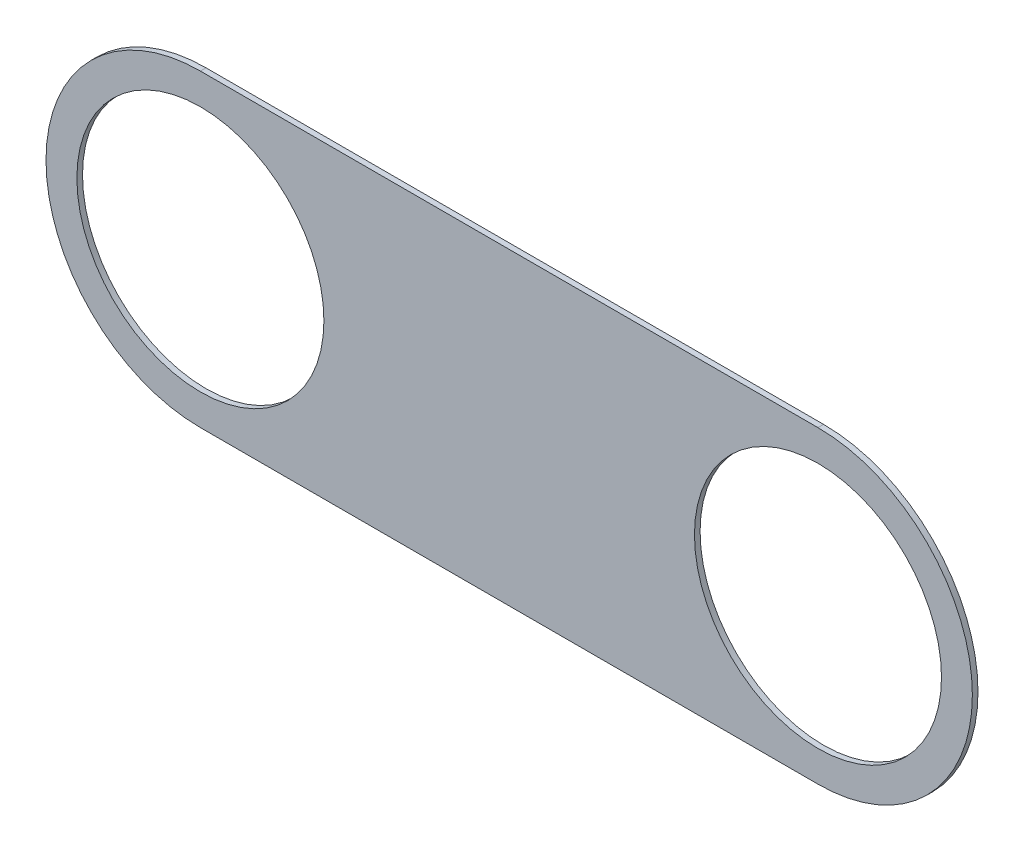
ISO-10303-21;
HEADER;
FILE_DESCRIPTION(('STEP AP214'),'2;1');
FILE_NAME('part.step','',(''),(''),'','','');
FILE_SCHEMA(('AUTOMOTIVE_DESIGN { 1 0 10303 214 1 1 1 1 }'));
ENDSEC;
DATA;
#1=APPLICATION_CONTEXT('core data for automotive mechanical design processes');
#2=APPLICATION_PROTOCOL_DEFINITION('international standard','automotive_design',2000,#1);
#3=PRODUCT_CONTEXT('',#1,'mechanical');
#4=PRODUCT('Part','Part','',(#3));
#5=PRODUCT_RELATED_PRODUCT_CATEGORY('part','',(#4));
#6=PRODUCT_DEFINITION_FORMATION('','',#4);
#7=PRODUCT_DEFINITION_CONTEXT('part definition',#1,'design');
#8=PRODUCT_DEFINITION('design','',#6,#7);
#9=PRODUCT_DEFINITION_SHAPE('','',#8);
#10=(LENGTH_UNIT() NAMED_UNIT(*) SI_UNIT(.MILLI.,.METRE.));
#11=(NAMED_UNIT(*) PLANE_ANGLE_UNIT() SI_UNIT($,.RADIAN.));
#12=(NAMED_UNIT(*) SI_UNIT($,.STERADIAN.) SOLID_ANGLE_UNIT());
#13=UNCERTAINTY_MEASURE_WITH_UNIT(LENGTH_MEASURE(1.E-05),#10,'distance_accuracy_value','');
#14=(GEOMETRIC_REPRESENTATION_CONTEXT(3) GLOBAL_UNCERTAINTY_ASSIGNED_CONTEXT((#13)) GLOBAL_UNIT_ASSIGNED_CONTEXT((#10,
#11,#12)) REPRESENTATION_CONTEXT('',''));
#15=CARTESIAN_POINT('',(0.,0.,0.));
#16=DIRECTION('',(0.,0.,1.));
#17=DIRECTION('',(1.,0.,0.));
#18=AXIS2_PLACEMENT_3D('',#15,#16,#17);
#19=CARTESIAN_POINT('',(-63.5,0.,1.15824));
#20=DIRECTION('',(0.,0.,1.));
#21=DIRECTION('',(1.,0.,0.));
#22=AXIS2_PLACEMENT_3D('',#19,#20,#21);
#23=PLANE('',#22);
#24=CARTESIAN_POINT('',(-63.5,0.,1.15824));
#25=DIRECTION('',(0.,0.,1.));
#26=DIRECTION('',(1.,0.,0.));
#27=AXIS2_PLACEMENT_3D('',#24,#25,#26);
#28=CIRCLE('',#27,25.4);
#29=CARTESIAN_POINT('',(-38.1,0.,1.15824));
#30=VERTEX_POINT('',#29);
#31=EDGE_CURVE('E102',#30,#30,#28,.T.);
#32=ORIENTED_EDGE('',*,*,#31,.F.);
#33=EDGE_LOOP('',(#32));
#34=FACE_BOUND('',#33,.T.);
#35=CARTESIAN_POINT('',(-63.5,0.,1.15824));
#36=DIRECTION('',(0.,0.,1.));
#37=DIRECTION('',(1.,0.,0.));
#38=AXIS2_PLACEMENT_3D('',#35,#36,#37);
#39=CIRCLE('',#38,31.75);
#40=CARTESIAN_POINT('',(-63.5,31.75,1.15824));
#41=VERTEX_POINT('',#40);
#42=CARTESIAN_POINT('',(-63.5,-31.75,1.15824));
#43=VERTEX_POINT('',#42);
#44=EDGE_CURVE('E87',#41,#43,#39,.T.);
#45=ORIENTED_EDGE('',*,*,#44,.T.);
#46=DIRECTION('',(1.,0.,0.));
#47=VECTOR('',#46,1.);
#48=CARTESIAN_POINT('',(-63.5,-31.75,1.15824));
#49=LINE('',#48,#47);
#50=CARTESIAN_POINT('',(63.5,-31.75,1.15824));
#51=VERTEX_POINT('',#50);
#52=EDGE_CURVE('E82',#43,#51,#49,.T.);
#53=ORIENTED_EDGE('',*,*,#52,.T.);
#54=CARTESIAN_POINT('',(63.5,0.,1.15824));
#55=DIRECTION('',(0.,0.,1.));
#56=DIRECTION('',(1.,0.,0.));
#57=AXIS2_PLACEMENT_3D('',#54,#55,#56);
#58=CIRCLE('',#57,31.75);
#59=CARTESIAN_POINT('',(63.5,31.75,1.15824));
#60=VERTEX_POINT('',#59);
#61=EDGE_CURVE('E85',#51,#60,#58,.T.);
#62=ORIENTED_EDGE('',*,*,#61,.T.);
#63=DIRECTION('',(-1.,0.,0.));
#64=VECTOR('',#63,1.);
#65=CARTESIAN_POINT('',(-63.5,31.75,1.15824));
#66=LINE('',#65,#64);
#67=EDGE_CURVE('E52',#60,#41,#66,.T.);
#68=ORIENTED_EDGE('',*,*,#67,.T.);
#69=EDGE_LOOP('',(#45,#53,#62,#68));
#70=FACE_BOUND('',#69,.T.);
#71=CARTESIAN_POINT('',(63.5,0.,1.15824));
#72=DIRECTION('',(0.,0.,1.));
#73=DIRECTION('',(1.,0.,0.));
#74=AXIS2_PLACEMENT_3D('',#71,#72,#73);
#75=CIRCLE('',#74,25.4);
#76=CARTESIAN_POINT('',(88.9,0.,1.15824));
#77=VERTEX_POINT('',#76);
#78=EDGE_CURVE('E117',#77,#77,#75,.T.);
#79=ORIENTED_EDGE('',*,*,#78,.F.);
#80=EDGE_LOOP('',(#79));
#81=FACE_BOUND('',#80,.T.);
#82=ADVANCED_FACE('F35',(#34,#70,#81),#23,.T.);
#83=CARTESIAN_POINT('',(-63.5,0.,0.));
#84=DIRECTION('',(0.,0.,1.));
#85=DIRECTION('',(1.,0.,0.));
#86=AXIS2_PLACEMENT_3D('',#83,#84,#85);
#87=PLANE('',#86);
#88=CARTESIAN_POINT('',(-63.5,0.,0.));
#89=DIRECTION('',(0.,0.,1.));
#90=DIRECTION('',(1.,0.,0.));
#91=AXIS2_PLACEMENT_3D('',#88,#89,#90);
#92=CIRCLE('',#91,25.4);
#93=CARTESIAN_POINT('',(-38.1,0.,0.));
#94=VERTEX_POINT('',#93);
#95=EDGE_CURVE('E114',#94,#94,#92,.T.);
#96=ORIENTED_EDGE('',*,*,#95,.T.);
#97=EDGE_LOOP('',(#96));
#98=FACE_BOUND('',#97,.T.);
#99=CARTESIAN_POINT('',(-63.5,0.,0.));
#100=DIRECTION('',(0.,0.,1.));
#101=DIRECTION('',(1.,0.,0.));
#102=AXIS2_PLACEMENT_3D('',#99,#100,#101);
#103=CIRCLE('',#102,31.75);
#104=CARTESIAN_POINT('',(-63.5,31.75,0.));
#105=VERTEX_POINT('',#104);
#106=CARTESIAN_POINT('',(-63.5,-31.75,0.));
#107=VERTEX_POINT('',#106);
#108=EDGE_CURVE('E99',#105,#107,#103,.T.);
#109=ORIENTED_EDGE('',*,*,#108,.F.);
#110=DIRECTION('',(-1.,0.,0.));
#111=VECTOR('',#110,1.);
#112=CARTESIAN_POINT('',(-63.5,31.75,0.));
#113=LINE('',#112,#111);
#114=CARTESIAN_POINT('',(63.5,31.75,0.));
#115=VERTEX_POINT('',#114);
#116=EDGE_CURVE('E75',#115,#105,#113,.T.);
#117=ORIENTED_EDGE('',*,*,#116,.F.);
#118=CARTESIAN_POINT('',(63.5,0.,0.));
#119=DIRECTION('',(0.,0.,1.));
#120=DIRECTION('',(1.,0.,0.));
#121=AXIS2_PLACEMENT_3D('',#118,#119,#120);
#122=CIRCLE('',#121,31.75);
#123=CARTESIAN_POINT('',(63.5,-31.75,0.));
#124=VERTEX_POINT('',#123);
#125=EDGE_CURVE('E69',#124,#115,#122,.T.);
#126=ORIENTED_EDGE('',*,*,#125,.F.);
#127=DIRECTION('',(1.,0.,0.));
#128=VECTOR('',#127,1.);
#129=CARTESIAN_POINT('',(-63.5,-31.75,0.));
#130=LINE('',#129,#128);
#131=EDGE_CURVE('E91',#107,#124,#130,.T.);
#132=ORIENTED_EDGE('',*,*,#131,.F.);
#133=EDGE_LOOP('',(#109,#117,#126,#132));
#134=FACE_BOUND('',#133,.T.);
#135=CARTESIAN_POINT('',(63.5,0.,0.));
#136=DIRECTION('',(0.,0.,1.));
#137=DIRECTION('',(1.,0.,0.));
#138=AXIS2_PLACEMENT_3D('',#135,#136,#137);
#139=CIRCLE('',#138,25.4);
#140=CARTESIAN_POINT('',(88.9,0.,0.));
#141=VERTEX_POINT('',#140);
#142=EDGE_CURVE('E120',#141,#141,#139,.T.);
#143=ORIENTED_EDGE('',*,*,#142,.T.);
#144=EDGE_LOOP('',(#143));
#145=FACE_BOUND('',#144,.T.);
#146=ADVANCED_FACE('F110',(#98,#134,#145),#87,.F.);
#147=CARTESIAN_POINT('',(-63.5,0.,1.15824));
#148=DIRECTION('',(0.,0.,-1.));
#149=DIRECTION('',(-1.,0.,0.));
#150=AXIS2_PLACEMENT_3D('',#147,#148,#149);
#151=CYLINDRICAL_SURFACE('',#150,31.75);
#152=ORIENTED_EDGE('',*,*,#108,.T.);
#153=DIRECTION('',(0.,0.,-1.));
#154=VECTOR('',#153,1.);
#155=CARTESIAN_POINT('',(-63.5,-31.75,1.15824));
#156=LINE('',#155,#154);
#157=EDGE_CURVE('E11',#43,#107,#156,.T.);
#158=ORIENTED_EDGE('',*,*,#157,.F.);
#159=ORIENTED_EDGE('',*,*,#44,.F.);
#160=DIRECTION('',(0.,0.,-1.));
#161=VECTOR('',#160,1.);
#162=CARTESIAN_POINT('',(-63.5,31.75,1.15824));
#163=LINE('',#162,#161);
#164=EDGE_CURVE('E95',#41,#105,#163,.T.);
#165=ORIENTED_EDGE('',*,*,#164,.T.);
#166=EDGE_LOOP('',(#152,#158,#159,#165));
#167=FACE_BOUND('',#166,.T.);
#168=ADVANCED_FACE('F37',(#167),#151,.T.);
#169=CARTESIAN_POINT('',(-63.5,-31.75,1.15824));
#170=DIRECTION('',(0.,1.,0.));
#171=DIRECTION('',(-1.,0.,0.));
#172=AXIS2_PLACEMENT_3D('',#169,#170,#171);
#173=PLANE('',#172);
#174=ORIENTED_EDGE('',*,*,#131,.T.);
#175=DIRECTION('',(0.,0.,-1.));
#176=VECTOR('',#175,1.);
#177=CARTESIAN_POINT('',(63.5,-31.75,1.15824));
#178=LINE('',#177,#176);
#179=EDGE_CURVE('E44',#51,#124,#178,.T.);
#180=ORIENTED_EDGE('',*,*,#179,.F.);
#181=ORIENTED_EDGE('',*,*,#52,.F.);
#182=ORIENTED_EDGE('',*,*,#157,.T.);
#183=EDGE_LOOP('',(#174,#180,#181,#182));
#184=FACE_BOUND('',#183,.T.);
#185=ADVANCED_FACE('F90',(#184),#173,.F.);
#186=CARTESIAN_POINT('',(63.5,0.,1.15824));
#187=DIRECTION('',(0.,0.,-1.));
#188=DIRECTION('',(-1.,0.,0.));
#189=AXIS2_PLACEMENT_3D('',#186,#187,#188);
#190=CYLINDRICAL_SURFACE('',#189,31.75);
#191=ORIENTED_EDGE('',*,*,#125,.T.);
#192=DIRECTION('',(0.,0.,-1.));
#193=VECTOR('',#192,1.);
#194=CARTESIAN_POINT('',(63.5,31.75,1.15824));
#195=LINE('',#194,#193);
#196=EDGE_CURVE('E92',#60,#115,#195,.T.);
#197=ORIENTED_EDGE('',*,*,#196,.F.);
#198=ORIENTED_EDGE('',*,*,#61,.F.);
#199=ORIENTED_EDGE('',*,*,#179,.T.);
#200=EDGE_LOOP('',(#191,#197,#198,#199));
#201=FACE_BOUND('',#200,.T.);
#202=ADVANCED_FACE('F93',(#201),#190,.T.);
#203=CARTESIAN_POINT('',(-63.5,31.75,1.15824));
#204=DIRECTION('',(0.,-1.,0.));
#205=DIRECTION('',(1.,0.,0.));
#206=AXIS2_PLACEMENT_3D('',#203,#204,#205);
#207=PLANE('',#206);
#208=ORIENTED_EDGE('',*,*,#116,.T.);
#209=ORIENTED_EDGE('',*,*,#164,.F.);
#210=ORIENTED_EDGE('',*,*,#67,.F.);
#211=ORIENTED_EDGE('',*,*,#196,.T.);
#212=EDGE_LOOP('',(#208,#209,#210,#211));
#213=FACE_BOUND('',#212,.T.);
#214=ADVANCED_FACE('F107',(#213),#207,.F.);
#215=CARTESIAN_POINT('',(-63.5,0.,1.15824));
#216=DIRECTION('',(0.,0.,-1.));
#217=DIRECTION('',(-1.,0.,0.));
#218=AXIS2_PLACEMENT_3D('',#215,#216,#217);
#219=CYLINDRICAL_SURFACE('',#218,25.4);
#220=ORIENTED_EDGE('',*,*,#31,.T.);
#221=EDGE_LOOP('',(#220));
#222=FACE_BOUND('',#221,.T.);
#223=ORIENTED_EDGE('',*,*,#95,.F.);
#224=EDGE_LOOP('',(#223));
#225=FACE_BOUND('',#224,.T.);
#226=ADVANCED_FACE('F138',(#222,#225),#219,.F.);
#227=CARTESIAN_POINT('',(63.5,0.,1.15824));
#228=DIRECTION('',(0.,0.,-1.));
#229=DIRECTION('',(-1.,0.,0.));
#230=AXIS2_PLACEMENT_3D('',#227,#228,#229);
#231=CYLINDRICAL_SURFACE('',#230,25.4);
#232=ORIENTED_EDGE('',*,*,#78,.T.);
#233=EDGE_LOOP('',(#232));
#234=FACE_BOUND('',#233,.T.);
#235=ORIENTED_EDGE('',*,*,#142,.F.);
#236=EDGE_LOOP('',(#235));
#237=FACE_BOUND('',#236,.T.);
#238=ADVANCED_FACE('F126',(#234,#237),#231,.F.);
#239=CLOSED_SHELL('',(#82,#146,#168,#185,#202,#214,#226,#238));
#240=MANIFOLD_SOLID_BREP('B2',#239);
#241=ADVANCED_BREP_SHAPE_REPRESENTATION('',(#18,#240),#14);
#242=SHAPE_DEFINITION_REPRESENTATION(#9,#241);
ENDSEC;
END-ISO-10303-21;
